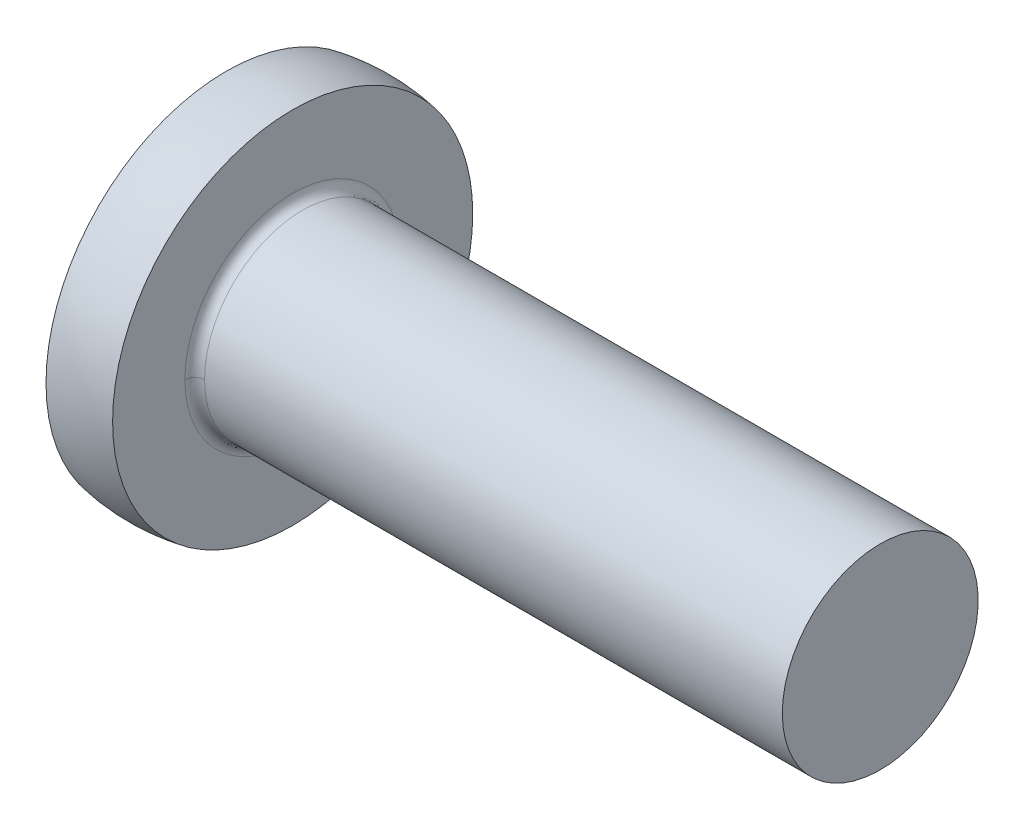
ISO-10303-21;
HEADER;
FILE_DESCRIPTION(('STEP AP214'),'2;1');
FILE_NAME('part.step','',(''),(''),'','','');
FILE_SCHEMA(('AUTOMOTIVE_DESIGN { 1 0 10303 214 1 1 1 1 }'));
ENDSEC;
DATA;
#1=APPLICATION_CONTEXT('core data for automotive mechanical design processes');
#2=APPLICATION_PROTOCOL_DEFINITION('international standard','automotive_design',2000,#1);
#3=PRODUCT_CONTEXT('',#1,'mechanical');
#4=PRODUCT('Part','Part','',(#3));
#5=PRODUCT_RELATED_PRODUCT_CATEGORY('part','',(#4));
#6=PRODUCT_DEFINITION_FORMATION('','',#4);
#7=PRODUCT_DEFINITION_CONTEXT('part definition',#1,'design');
#8=PRODUCT_DEFINITION('design','',#6,#7);
#9=PRODUCT_DEFINITION_SHAPE('','',#8);
#10=(LENGTH_UNIT() NAMED_UNIT(*) SI_UNIT(.MILLI.,.METRE.));
#11=(NAMED_UNIT(*) PLANE_ANGLE_UNIT() SI_UNIT($,.RADIAN.));
#12=(NAMED_UNIT(*) SI_UNIT($,.STERADIAN.) SOLID_ANGLE_UNIT());
#13=UNCERTAINTY_MEASURE_WITH_UNIT(LENGTH_MEASURE(1.E-05),#10,'distance_accuracy_value','');
#14=(GEOMETRIC_REPRESENTATION_CONTEXT(3) GLOBAL_UNCERTAINTY_ASSIGNED_CONTEXT((#13)) GLOBAL_UNIT_ASSIGNED_CONTEXT((#10,
#11,#12)) REPRESENTATION_CONTEXT('',''));
#15=CARTESIAN_POINT('',(0.,0.,0.));
#16=DIRECTION('',(0.,0.,1.));
#17=DIRECTION('',(1.,0.,0.));
#18=AXIS2_PLACEMENT_3D('',#15,#16,#17);
#19=CARTESIAN_POINT('',(0.,-1.860897124,1.860897124));
#20=DIRECTION('',(1.,0.,0.));
#21=DIRECTION('',(0.,0.,-1.));
#22=AXIS2_PLACEMENT_3D('',#19,#20,#21);
#23=PLANE('',#22);
#24=CARTESIAN_POINT('',(0.,0.,0.));
#25=DIRECTION('',(-1.,0.,0.));
#26=DIRECTION('',(0.,0.,1.));
#27=AXIS2_PLACEMENT_3D('',#24,#25,#26);
#28=CIRCLE('',#27,1.83883115048663);
#29=CARTESIAN_POINT('',(0.,0.,1.83883115048663));
#30=VERTEX_POINT('',#29);
#31=EDGE_CURVE('E22',#30,#30,#28,.T.);
#32=ORIENTED_EDGE('',*,*,#31,.T.);
#33=EDGE_LOOP('',(#32));
#34=FACE_BOUND('',#33,.T.);
#35=ADVANCED_FACE('F17',(#34),#23,.F.);
#36=CARTESIAN_POINT('',(6.68,-1.012,-1.012));
#37=DIRECTION('',(-1.,0.,0.));
#38=DIRECTION('',(0.,0.,1.));
#39=AXIS2_PLACEMENT_3D('',#36,#37,#38);
#40=PLANE('',#39);
#41=CARTESIAN_POINT('',(6.68,0.,0.));
#42=DIRECTION('',(-1.,0.,0.));
#43=DIRECTION('',(0.,0.,1.));
#44=AXIS2_PLACEMENT_3D('',#41,#42,#43);
#45=CIRCLE('',#44,1.);
#46=CARTESIAN_POINT('',(6.68,0.,1.));
#47=VERTEX_POINT('',#46);
#48=EDGE_CURVE('E57',#47,#47,#45,.F.);
#49=ORIENTED_EDGE('',*,*,#48,.T.);
#50=EDGE_LOOP('',(#49));
#51=FACE_BOUND('',#50,.T.);
#52=ADVANCED_FACE('F81',(#51),#40,.F.);
#53=CARTESIAN_POINT('',(0.34,0.,0.));
#54=DIRECTION('',(-1.,0.,0.));
#55=DIRECTION('',(0.,-1.,0.));
#56=AXIS2_PLACEMENT_3D('',#53,#54,#55);
#57=SPHERICAL_SURFACE('',#56,1.87);
#58=ORIENTED_EDGE('',*,*,#31,.F.);
#59=EDGE_LOOP('',(#58));
#60=FACE_BOUND('',#59,.T.);
#61=CARTESIAN_POINT('',(0.68,0.,0.));
#62=DIRECTION('',(-1.,0.,0.));
#63=DIRECTION('',(0.,0.,1.));
#64=AXIS2_PLACEMENT_3D('',#61,#62,#63);
#65=CIRCLE('',#64,1.83883115048663);
#66=CARTESIAN_POINT('',(0.68,0.,1.83883115048663));
#67=VERTEX_POINT('',#66);
#68=EDGE_CURVE('E60',#67,#67,#65,.T.);
#69=ORIENTED_EDGE('',*,*,#68,.T.);
#70=EDGE_LOOP('',(#69));
#71=FACE_BOUND('',#70,.T.);
#72=ADVANCED_FACE('F77',(#60,#71),#57,.T.);
#73=CARTESIAN_POINT('',(0.789983342,0.,1.000499583));
#74=CARTESIAN_POINT('',(0.789983342,2.000999167,1.000499583));
#75=CARTESIAN_POINT('',(0.789983342,2.000999167,-1.000499583));
#76=CARTESIAN_POINT('',(0.789983342,0.,-1.000499583));
#77=CARTESIAN_POINT('',(0.721994623,0.,0.993677958));
#78=CARTESIAN_POINT('',(0.721994623,1.987355915,0.993677958));
#79=CARTESIAN_POINT('',(0.721994623,1.987355915,-0.993677958));
#80=CARTESIAN_POINT('',(0.721994623,0.,-0.993677958));
#81=CARTESIAN_POINT('',(0.673677958,0.,1.041994623));
#82=CARTESIAN_POINT('',(0.673677958,2.083989247,1.041994623));
#83=CARTESIAN_POINT('',(0.673677958,2.083989247,-1.041994623));
#84=CARTESIAN_POINT('',(0.673677958,0.,-1.041994623));
#85=CARTESIAN_POINT('',(0.680499583,0.,1.109983342));
#86=CARTESIAN_POINT('',(0.680499583,2.219966683,1.109983342));
#87=CARTESIAN_POINT('',(0.680499583,2.219966683,-1.109983342));
#88=CARTESIAN_POINT('',(0.680499583,0.,-1.109983342));
#89=(BOUNDED_SURFACE() B_SPLINE_SURFACE(3,3,((#73,#74,#75,#76),(#77,#78,#79,#80),(#81,#82,#83,
#84),(#85,#86,#87,#88)),.UNSPECIFIED.,.F.,.F.,.F.) B_SPLINE_SURFACE_WITH_KNOTS((4,4),(4,4),(0.,
1.),(0.,1.),.UNSPECIFIED.) GEOMETRIC_REPRESENTATION_ITEM() RATIONAL_B_SPLINE_SURFACE(((1.,
0.333333333333333,0.333333333333333,1.),(0.755320871117972,0.251773623705991,0.251773623705991,
0.755320871117972),(0.755320871117972,0.251773623705991,0.251773623705991,0.755320871117972),
(1.,0.333333333333333,0.333333333333333,1.))) REPRESENTATION_ITEM('') SURFACE());
#90=CARTESIAN_POINT('',(0.679999999625739,0.,-1.10000000036693));
#91=CARTESIAN_POINT('',(0.679999999625739,2.19999999999695,-1.10000000036693));
#92=CARTESIAN_POINT('',(0.679999999625739,2.19999999999695,1.10000000036693));
#93=CARTESIAN_POINT('',(0.679999999625739,0.,1.10000000036693));
#94=(BOUNDED_CURVE() B_SPLINE_CURVE(3,(#90,#91,#92,#93),.UNSPECIFIED.,.F.,
.F.) B_SPLINE_CURVE_WITH_KNOTS((4,4),(0.,1.),
.UNSPECIFIED.) CURVE() GEOMETRIC_REPRESENTATION_ITEM() RATIONAL_B_SPLINE_CURVE((0.956578302900928,
0.318859434300309,0.318859434300309,0.956578302900928)) REPRESENTATION_ITEM(''));
#95=CARTESIAN_POINT('',(0.679999999775444,0.,-1.10000000080208));
#96=VERTEX_POINT('',#95);
#97=CARTESIAN_POINT('',(0.679999999775444,0.,1.10000000080208));
#98=VERTEX_POINT('',#97);
#99=EDGE_CURVE('E52',#96,#98,#94,.T.);
#100=CARTESIAN_POINT('',(0.789983342,0.,1.000499583));
#101=CARTESIAN_POINT('',(0.721994623,0.,0.993677958));
#102=CARTESIAN_POINT('',(0.673677958,0.,1.041994623));
#103=CARTESIAN_POINT('',(0.680499583,0.,1.109983342));
#104=(BOUNDED_CURVE() B_SPLINE_CURVE(3,(#100,#101,#102,#103),.UNSPECIFIED.,.F.,
.F.) B_SPLINE_CURVE_WITH_KNOTS((4,4),(0.,1.),
.UNSPECIFIED.) CURVE() GEOMETRIC_REPRESENTATION_ITEM() RATIONAL_B_SPLINE_CURVE((1.,
0.755320871117972,0.755320871117972,1.)) REPRESENTATION_ITEM(''));
#105=CARTESIAN_POINT('',(0.780000000158767,-6.7345221317349E-11,0.999999999719304));
#106=VERTEX_POINT('',#105);
#107=EDGE_CURVE('E42',#106,#98,#104,.T.);
#108=CARTESIAN_POINT('',(0.780000000181448,0.,0.));
#109=DIRECTION('',(1.,0.,0.));
#110=DIRECTION('',(0.,0.,-1.));
#111=AXIS2_PLACEMENT_3D('',#108,#109,#110);
#112=CIRCLE('',#111,0.999999999625739);
#113=CARTESIAN_POINT('',(0.780000000147427,-2.43560321324774E-10,-0.999999999719304));
#114=VERTEX_POINT('',#113);
#115=EDGE_CURVE('E45',#114,#106,#112,.T.);
#116=CARTESIAN_POINT('',(0.789983342,0.,-1.000499583));
#117=CARTESIAN_POINT('',(0.721994623,0.,-0.993677958));
#118=CARTESIAN_POINT('',(0.673677958,0.,-1.041994623));
#119=CARTESIAN_POINT('',(0.680499583,0.,-1.109983342));
#120=(BOUNDED_CURVE() B_SPLINE_CURVE(3,(#116,#117,#118,#119),.UNSPECIFIED.,.F.,
.F.) B_SPLINE_CURVE_WITH_KNOTS((4,4),(0.,1.),
.UNSPECIFIED.) CURVE() GEOMETRIC_REPRESENTATION_ITEM() RATIONAL_B_SPLINE_CURVE((1.,
0.755320871117972,0.755320871117972,1.)) REPRESENTATION_ITEM(''));
#121=EDGE_CURVE('E36',#96,#114,#120,.F.);
#122=ORIENTED_EDGE('',*,*,#99,.T.);
#123=ORIENTED_EDGE('',*,*,#107,.F.);
#124=ORIENTED_EDGE('',*,*,#115,.F.);
#125=ORIENTED_EDGE('',*,*,#121,.F.);
#126=EDGE_LOOP('',(#122,#123,#124,#125));
#127=FACE_BOUND('',#126,.T.);
#128=ADVANCED_FACE('F47',(#127),#89,.F.);
#129=CARTESIAN_POINT('',(6.68,0.,0.));
#130=DIRECTION('',(-1.,0.,0.));
#131=DIRECTION('',(0.,0.,1.));
#132=AXIS2_PLACEMENT_3D('',#129,#130,#131);
#133=CYLINDRICAL_SURFACE('',#132,1.);
#134=ORIENTED_EDGE('',*,*,#48,.F.);
#135=EDGE_LOOP('',(#134));
#136=FACE_BOUND('',#135,.T.);
#137=ORIENTED_EDGE('',*,*,#115,.T.);
#138=CARTESIAN_POINT('',(0.780000000181448,0.,0.));
#139=DIRECTION('',(1.,0.,0.));
#140=DIRECTION('',(0.,0.,-1.));
#141=AXIS2_PLACEMENT_3D('',#138,#139,#140);
#142=CIRCLE('',#141,0.999999999625739);
#143=EDGE_CURVE('E28',#106,#114,#142,.T.);
#144=ORIENTED_EDGE('',*,*,#143,.T.);
#145=EDGE_LOOP('',(#137,#144));
#146=FACE_BOUND('',#145,.T.);
#147=ADVANCED_FACE('F50',(#136,#146),#133,.T.);
#148=CARTESIAN_POINT('',(0.68,-1.860897124,-1.860897124));
#149=DIRECTION('',(-1.,0.,0.));
#150=DIRECTION('',(0.,0.,1.));
#151=AXIS2_PLACEMENT_3D('',#148,#149,#150);
#152=PLANE('',#151);
#153=CARTESIAN_POINT('',(0.679999999625739,0.,1.10000000036693));
#154=CARTESIAN_POINT('',(0.679999999625739,-2.19999999999695,1.10000000036693));
#155=CARTESIAN_POINT('',(0.679999999625739,-2.19999999999695,-1.10000000036693));
#156=CARTESIAN_POINT('',(0.679999999625739,0.,-1.10000000036693));
#157=(BOUNDED_CURVE() B_SPLINE_CURVE(3,(#153,#154,#155,#156),.UNSPECIFIED.,.F.,
.F.) B_SPLINE_CURVE_WITH_KNOTS((4,4),(0.,1.),
.UNSPECIFIED.) CURVE() GEOMETRIC_REPRESENTATION_ITEM() RATIONAL_B_SPLINE_CURVE((0.956578302900928,
0.318859434300309,0.318859434300309,0.956578302900928)) REPRESENTATION_ITEM(''));
#158=EDGE_CURVE('E11',#96,#98,#157,.F.);
#159=ORIENTED_EDGE('',*,*,#158,.T.);
#160=ORIENTED_EDGE('',*,*,#99,.F.);
#161=EDGE_LOOP('',(#159,#160));
#162=FACE_BOUND('',#161,.T.);
#163=ORIENTED_EDGE('',*,*,#68,.F.);
#164=EDGE_LOOP('',(#163));
#165=FACE_BOUND('',#164,.T.);
#166=ADVANCED_FACE('F19',(#162,#165),#152,.F.);
#167=CARTESIAN_POINT('',(0.789983342,0.,-1.000499583));
#168=CARTESIAN_POINT('',(0.789983342,-2.000999167,-1.000499583));
#169=CARTESIAN_POINT('',(0.789983342,-2.000999167,1.000499583));
#170=CARTESIAN_POINT('',(0.789983342,0.,1.000499583));
#171=CARTESIAN_POINT('',(0.721994623,0.,-0.993677958));
#172=CARTESIAN_POINT('',(0.721994623,-1.987355915,-0.993677958));
#173=CARTESIAN_POINT('',(0.721994623,-1.987355915,0.993677958));
#174=CARTESIAN_POINT('',(0.721994623,0.,0.993677958));
#175=CARTESIAN_POINT('',(0.673677958,0.,-1.041994623));
#176=CARTESIAN_POINT('',(0.673677958,-2.083989247,-1.041994623));
#177=CARTESIAN_POINT('',(0.673677958,-2.083989247,1.041994623));
#178=CARTESIAN_POINT('',(0.673677958,0.,1.041994623));
#179=CARTESIAN_POINT('',(0.680499583,0.,-1.109983342));
#180=CARTESIAN_POINT('',(0.680499583,-2.219966683,-1.109983342));
#181=CARTESIAN_POINT('',(0.680499583,-2.219966683,1.109983342));
#182=CARTESIAN_POINT('',(0.680499583,0.,1.109983342));
#183=(BOUNDED_SURFACE() B_SPLINE_SURFACE(3,3,((#167,#168,#169,#170),(#171,#172,#173,#174),(#175,
#176,#177,#178),(#179,#180,#181,#182)),.UNSPECIFIED.,.F.,.F.,
.F.) B_SPLINE_SURFACE_WITH_KNOTS((4,4),(4,4),(0.,1.),(0.,1.),
.UNSPECIFIED.) GEOMETRIC_REPRESENTATION_ITEM() RATIONAL_B_SPLINE_SURFACE(((1.,0.333333333333333,
0.333333333333333,1.),(0.755320871117972,0.251773623705991,0.251773623705991,0.755320871117972),
(0.755320871117972,0.251773623705991,0.251773623705991,0.755320871117972),(1.,0.333333333333333,
0.333333333333333,1.))) REPRESENTATION_ITEM('') SURFACE());
#184=ORIENTED_EDGE('',*,*,#121,.T.);
#185=ORIENTED_EDGE('',*,*,#143,.F.);
#186=ORIENTED_EDGE('',*,*,#107,.T.);
#187=ORIENTED_EDGE('',*,*,#158,.F.);
#188=EDGE_LOOP('',(#184,#185,#186,#187));
#189=FACE_BOUND('',#188,.T.);
#190=ADVANCED_FACE('F55',(#189),#183,.F.);
#191=CLOSED_SHELL('',(#35,#52,#72,#128,#147,#166,#190));
#192=MANIFOLD_SOLID_BREP('B1',#191);
#193=ADVANCED_BREP_SHAPE_REPRESENTATION('',(#18,#192),#14);
#194=SHAPE_DEFINITION_REPRESENTATION(#9,#193);
ENDSEC;
END-ISO-10303-21;
